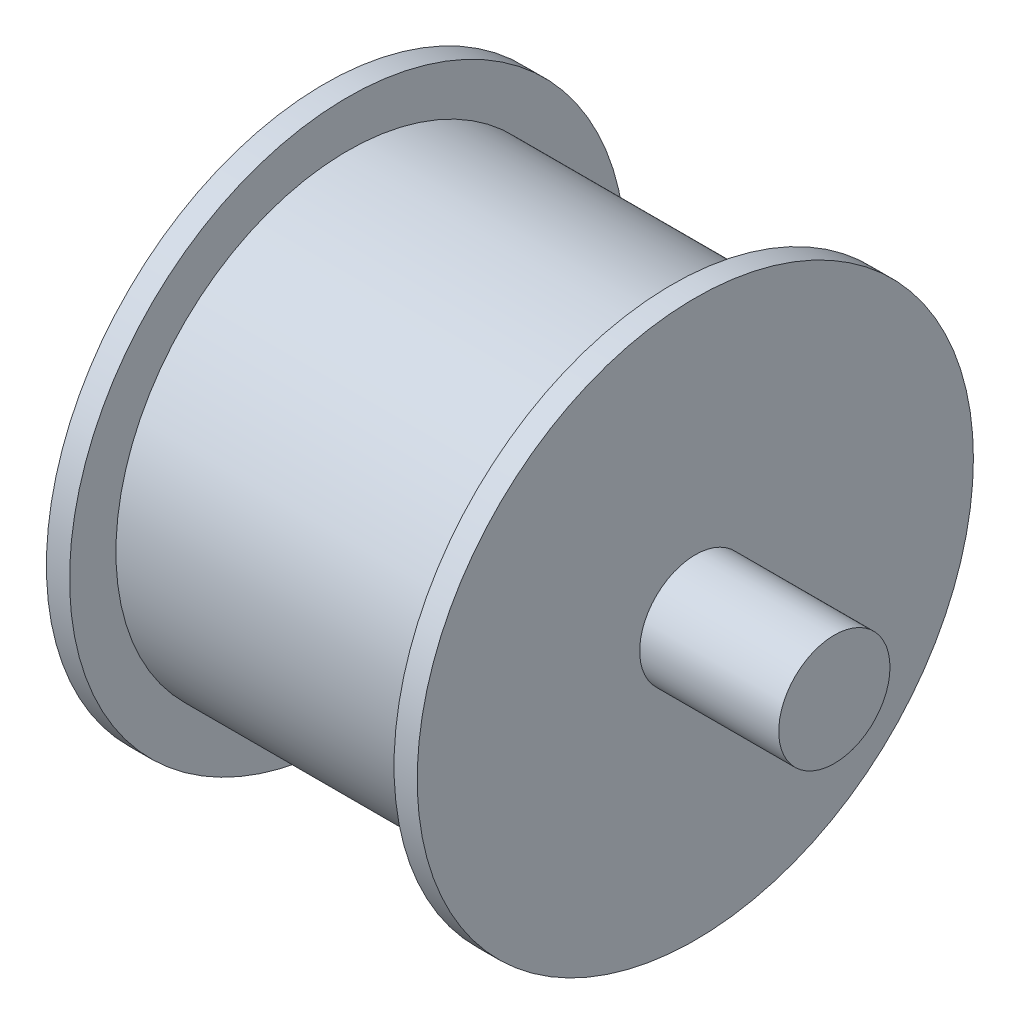
ISO-10303-21;
HEADER;
FILE_DESCRIPTION(('STEP AP214'),'2;1');
FILE_NAME('part.step','',(''),(''),'','','');
FILE_SCHEMA(('AUTOMOTIVE_DESIGN { 1 0 10303 214 1 1 1 1 }'));
ENDSEC;
DATA;
#1=APPLICATION_CONTEXT('core data for automotive mechanical design processes');
#2=APPLICATION_PROTOCOL_DEFINITION('international standard','automotive_design',2000,#1);
#3=PRODUCT_CONTEXT('',#1,'mechanical');
#4=PRODUCT('Part','Part','',(#3));
#5=PRODUCT_RELATED_PRODUCT_CATEGORY('part','',(#4));
#6=PRODUCT_DEFINITION_FORMATION('','',#4);
#7=PRODUCT_DEFINITION_CONTEXT('part definition',#1,'design');
#8=PRODUCT_DEFINITION('design','',#6,#7);
#9=PRODUCT_DEFINITION_SHAPE('','',#8);
#10=(LENGTH_UNIT() NAMED_UNIT(*) SI_UNIT(.MILLI.,.METRE.));
#11=(NAMED_UNIT(*) PLANE_ANGLE_UNIT() SI_UNIT($,.RADIAN.));
#12=(NAMED_UNIT(*) SI_UNIT($,.STERADIAN.) SOLID_ANGLE_UNIT());
#13=UNCERTAINTY_MEASURE_WITH_UNIT(LENGTH_MEASURE(1.E-05),#10,'distance_accuracy_value','');
#14=(GEOMETRIC_REPRESENTATION_CONTEXT(3) GLOBAL_UNCERTAINTY_ASSIGNED_CONTEXT((#13)) GLOBAL_UNIT_ASSIGNED_CONTEXT((#10,
#11,#12)) REPRESENTATION_CONTEXT('',''));
#15=CARTESIAN_POINT('',(0.,0.,0.));
#16=DIRECTION('',(0.,0.,1.));
#17=DIRECTION('',(1.,0.,0.));
#18=AXIS2_PLACEMENT_3D('',#15,#16,#17);
#19=CARTESIAN_POINT('',(-15.,0.,0.));
#20=DIRECTION('',(1.,0.,0.));
#21=DIRECTION('',(0.,0.,-1.));
#22=AXIS2_PLACEMENT_3D('',#19,#20,#21);
#23=CYLINDRICAL_SURFACE('',#22,6.);
#24=CARTESIAN_POINT('',(-15.,0.,0.));
#25=DIRECTION('',(1.,0.,0.));
#26=DIRECTION('',(0.,0.,-1.));
#27=AXIS2_PLACEMENT_3D('',#24,#25,#26);
#28=CIRCLE('',#27,6.);
#29=CARTESIAN_POINT('',(-15.,0.,-6.));
#30=VERTEX_POINT('',#29);
#31=EDGE_CURVE('E42',#30,#30,#28,.T.);
#32=ORIENTED_EDGE('',*,*,#31,.T.);
#33=EDGE_LOOP('',(#32));
#34=FACE_BOUND('',#33,.T.);
#35=CARTESIAN_POINT('',(0.,0.,0.));
#36=DIRECTION('',(1.,0.,0.));
#37=DIRECTION('',(0.,0.,-1.));
#38=AXIS2_PLACEMENT_3D('',#35,#36,#37);
#39=CIRCLE('',#38,6.);
#40=CARTESIAN_POINT('',(0.,0.,-6.));
#41=VERTEX_POINT('',#40);
#42=EDGE_CURVE('E33',#41,#41,#39,.T.);
#43=ORIENTED_EDGE('',*,*,#42,.F.);
#44=EDGE_LOOP('',(#43));
#45=FACE_BOUND('',#44,.T.);
#46=ADVANCED_FACE('F30',(#34,#45),#23,.T.);
#47=CARTESIAN_POINT('',(-15.,0.,0.));
#48=DIRECTION('',(1.,0.,0.));
#49=DIRECTION('',(0.,0.,-1.));
#50=AXIS2_PLACEMENT_3D('',#47,#48,#49);
#51=PLANE('',#50);
#52=ORIENTED_EDGE('',*,*,#31,.F.);
#53=EDGE_LOOP('',(#52));
#54=FACE_BOUND('',#53,.T.);
#55=ADVANCED_FACE('F71',(#54),#51,.F.);
#56=CARTESIAN_POINT('',(2.5,0.,0.));
#57=DIRECTION('',(-1.,0.,0.));
#58=DIRECTION('',(0.,0.,1.));
#59=AXIS2_PLACEMENT_3D('',#56,#57,#58);
#60=CYLINDRICAL_SURFACE('',#59,30.);
#61=CARTESIAN_POINT('',(2.5,0.,0.));
#62=DIRECTION('',(1.,0.,0.));
#63=DIRECTION('',(0.,0.,-1.));
#64=AXIS2_PLACEMENT_3D('',#61,#62,#63);
#65=CIRCLE('',#64,30.);
#66=CARTESIAN_POINT('',(2.5,0.,-30.));
#67=VERTEX_POINT('',#66);
#68=EDGE_CURVE('E57',#67,#67,#65,.T.);
#69=ORIENTED_EDGE('',*,*,#68,.F.);
#70=EDGE_LOOP('',(#69));
#71=FACE_BOUND('',#70,.T.);
#72=CARTESIAN_POINT('',(0.,0.,0.));
#73=DIRECTION('',(1.,0.,0.));
#74=DIRECTION('',(0.,0.,-1.));
#75=AXIS2_PLACEMENT_3D('',#72,#73,#74);
#76=CIRCLE('',#75,30.);
#77=CARTESIAN_POINT('',(0.,0.,-30.));
#78=VERTEX_POINT('',#77);
#79=EDGE_CURVE('E55',#78,#78,#76,.T.);
#80=ORIENTED_EDGE('',*,*,#79,.T.);
#81=EDGE_LOOP('',(#80));
#82=FACE_BOUND('',#81,.T.);
#83=ADVANCED_FACE('F75',(#71,#82),#60,.T.);
#84=CARTESIAN_POINT('',(2.5,0.,0.));
#85=DIRECTION('',(1.,0.,0.));
#86=DIRECTION('',(0.,0.,-1.));
#87=AXIS2_PLACEMENT_3D('',#84,#85,#86);
#88=PLANE('',#87);
#89=CARTESIAN_POINT('',(2.5,0.,0.));
#90=DIRECTION('',(1.,0.,0.));
#91=DIRECTION('',(0.,0.,-1.));
#92=AXIS2_PLACEMENT_3D('',#89,#90,#91);
#93=CIRCLE('',#92,25.);
#94=CARTESIAN_POINT('',(2.5,0.,-25.));
#95=VERTEX_POINT('',#94);
#96=EDGE_CURVE('E37',#95,#95,#93,.T.);
#97=ORIENTED_EDGE('',*,*,#96,.F.);
#98=EDGE_LOOP('',(#97));
#99=FACE_BOUND('',#98,.T.);
#100=ORIENTED_EDGE('',*,*,#68,.T.);
#101=EDGE_LOOP('',(#100));
#102=FACE_BOUND('',#101,.T.);
#103=ADVANCED_FACE('F80',(#99,#102),#88,.T.);
#104=CARTESIAN_POINT('',(0.,0.,0.));
#105=DIRECTION('',(1.,0.,0.));
#106=DIRECTION('',(0.,0.,-1.));
#107=AXIS2_PLACEMENT_3D('',#104,#105,#106);
#108=PLANE('',#107);
#109=ORIENTED_EDGE('',*,*,#42,.T.);
#110=EDGE_LOOP('',(#109));
#111=FACE_BOUND('',#110,.T.);
#112=ORIENTED_EDGE('',*,*,#79,.F.);
#113=EDGE_LOOP('',(#112));
#114=FACE_BOUND('',#113,.T.);
#115=ADVANCED_FACE('F67',(#111,#114),#108,.F.);
#116=CARTESIAN_POINT('',(20.,0.,0.));
#117=DIRECTION('',(-1.,0.,0.));
#118=DIRECTION('',(0.,0.,1.));
#119=AXIS2_PLACEMENT_3D('',#116,#117,#118);
#120=CYLINDRICAL_SURFACE('',#119,25.);
#121=ORIENTED_EDGE('',*,*,#96,.T.);
#122=EDGE_LOOP('',(#121));
#123=FACE_BOUND('',#122,.T.);
#124=CARTESIAN_POINT('',(37.5,0.,0.));
#125=DIRECTION('',(1.,0.,0.));
#126=DIRECTION('',(0.,0.,-1.));
#127=AXIS2_PLACEMENT_3D('',#124,#125,#126);
#128=CIRCLE('',#127,25.);
#129=CARTESIAN_POINT('',(37.5,0.,-25.));
#130=VERTEX_POINT('',#129);
#131=EDGE_CURVE('E50',#130,#130,#128,.T.);
#132=ORIENTED_EDGE('',*,*,#131,.F.);
#133=EDGE_LOOP('',(#132));
#134=FACE_BOUND('',#133,.T.);
#135=ADVANCED_FACE('F86',(#123,#134),#120,.T.);
#136=CARTESIAN_POINT('',(37.5,0.,0.));
#137=DIRECTION('',(1.,0.,0.));
#138=DIRECTION('',(0.,0.,-1.));
#139=AXIS2_PLACEMENT_3D('',#136,#137,#138);
#140=CYLINDRICAL_SURFACE('',#139,30.);
#141=CARTESIAN_POINT('',(37.5,0.,0.));
#142=DIRECTION('',(1.,0.,0.));
#143=DIRECTION('',(0.,0.,-1.));
#144=AXIS2_PLACEMENT_3D('',#141,#142,#143);
#145=CIRCLE('',#144,30.);
#146=CARTESIAN_POINT('',(37.5,0.,-30.));
#147=VERTEX_POINT('',#146);
#148=EDGE_CURVE('E47',#147,#147,#145,.T.);
#149=ORIENTED_EDGE('',*,*,#148,.T.);
#150=EDGE_LOOP('',(#149));
#151=FACE_BOUND('',#150,.T.);
#152=CARTESIAN_POINT('',(40.,0.,0.));
#153=DIRECTION('',(1.,0.,0.));
#154=DIRECTION('',(0.,0.,-1.));
#155=AXIS2_PLACEMENT_3D('',#152,#153,#154);
#156=CIRCLE('',#155,30.);
#157=CARTESIAN_POINT('',(40.,0.,-30.));
#158=VERTEX_POINT('',#157);
#159=EDGE_CURVE('E51',#158,#158,#156,.T.);
#160=ORIENTED_EDGE('',*,*,#159,.F.);
#161=EDGE_LOOP('',(#160));
#162=FACE_BOUND('',#161,.T.);
#163=ADVANCED_FACE('F92',(#151,#162),#140,.T.);
#164=CARTESIAN_POINT('',(37.5,0.,0.));
#165=DIRECTION('',(-1.,0.,0.));
#166=DIRECTION('',(0.,0.,-1.));
#167=AXIS2_PLACEMENT_3D('',#164,#165,#166);
#168=PLANE('',#167);
#169=ORIENTED_EDGE('',*,*,#131,.T.);
#170=EDGE_LOOP('',(#169));
#171=FACE_BOUND('',#170,.T.);
#172=ORIENTED_EDGE('',*,*,#148,.F.);
#173=EDGE_LOOP('',(#172));
#174=FACE_BOUND('',#173,.T.);
#175=ADVANCED_FACE('F96',(#171,#174),#168,.T.);
#176=CARTESIAN_POINT('',(40.,0.,0.));
#177=DIRECTION('',(-1.,0.,0.));
#178=DIRECTION('',(0.,0.,-1.));
#179=AXIS2_PLACEMENT_3D('',#176,#177,#178);
#180=PLANE('',#179);
#181=CARTESIAN_POINT('',(40.,0.,0.));
#182=DIRECTION('',(1.,0.,0.));
#183=DIRECTION('',(0.,0.,-1.));
#184=AXIS2_PLACEMENT_3D('',#181,#182,#183);
#185=CIRCLE('',#184,6.);
#186=CARTESIAN_POINT('',(40.,0.,-6.));
#187=VERTEX_POINT('',#186);
#188=EDGE_CURVE('E10',#187,#187,#185,.T.);
#189=ORIENTED_EDGE('',*,*,#188,.F.);
#190=EDGE_LOOP('',(#189));
#191=FACE_BOUND('',#190,.T.);
#192=ORIENTED_EDGE('',*,*,#159,.T.);
#193=EDGE_LOOP('',(#192));
#194=FACE_BOUND('',#193,.T.);
#195=ADVANCED_FACE('F98',(#191,#194),#180,.F.);
#196=CARTESIAN_POINT('',(55.,0.,0.));
#197=DIRECTION('',(-1.,0.,0.));
#198=DIRECTION('',(0.,0.,1.));
#199=AXIS2_PLACEMENT_3D('',#196,#197,#198);
#200=CYLINDRICAL_SURFACE('',#199,6.);
#201=CARTESIAN_POINT('',(55.,0.,0.));
#202=DIRECTION('',(1.,0.,0.));
#203=DIRECTION('',(0.,0.,-1.));
#204=AXIS2_PLACEMENT_3D('',#201,#202,#203);
#205=CIRCLE('',#204,6.);
#206=CARTESIAN_POINT('',(55.,0.,-6.));
#207=VERTEX_POINT('',#206);
#208=EDGE_CURVE('E46',#207,#207,#205,.T.);
#209=ORIENTED_EDGE('',*,*,#208,.F.);
#210=EDGE_LOOP('',(#209));
#211=FACE_BOUND('',#210,.T.);
#212=ORIENTED_EDGE('',*,*,#188,.T.);
#213=EDGE_LOOP('',(#212));
#214=FACE_BOUND('',#213,.T.);
#215=ADVANCED_FACE('F101',(#211,#214),#200,.T.);
#216=CARTESIAN_POINT('',(55.,0.,0.));
#217=DIRECTION('',(-1.,0.,0.));
#218=DIRECTION('',(0.,0.,-1.));
#219=AXIS2_PLACEMENT_3D('',#216,#217,#218);
#220=PLANE('',#219);
#221=ORIENTED_EDGE('',*,*,#208,.T.);
#222=EDGE_LOOP('',(#221));
#223=FACE_BOUND('',#222,.T.);
#224=ADVANCED_FACE('F108',(#223),#220,.F.);
#225=CLOSED_SHELL('',(#46,#55,#83,#103,#115,#135,#163,#175,#195,#215,#224));
#226=MANIFOLD_SOLID_BREP('B2',#225);
#227=ADVANCED_BREP_SHAPE_REPRESENTATION('',(#18,#226),#14);
#228=SHAPE_DEFINITION_REPRESENTATION(#9,#227);
ENDSEC;
END-ISO-10303-21;
